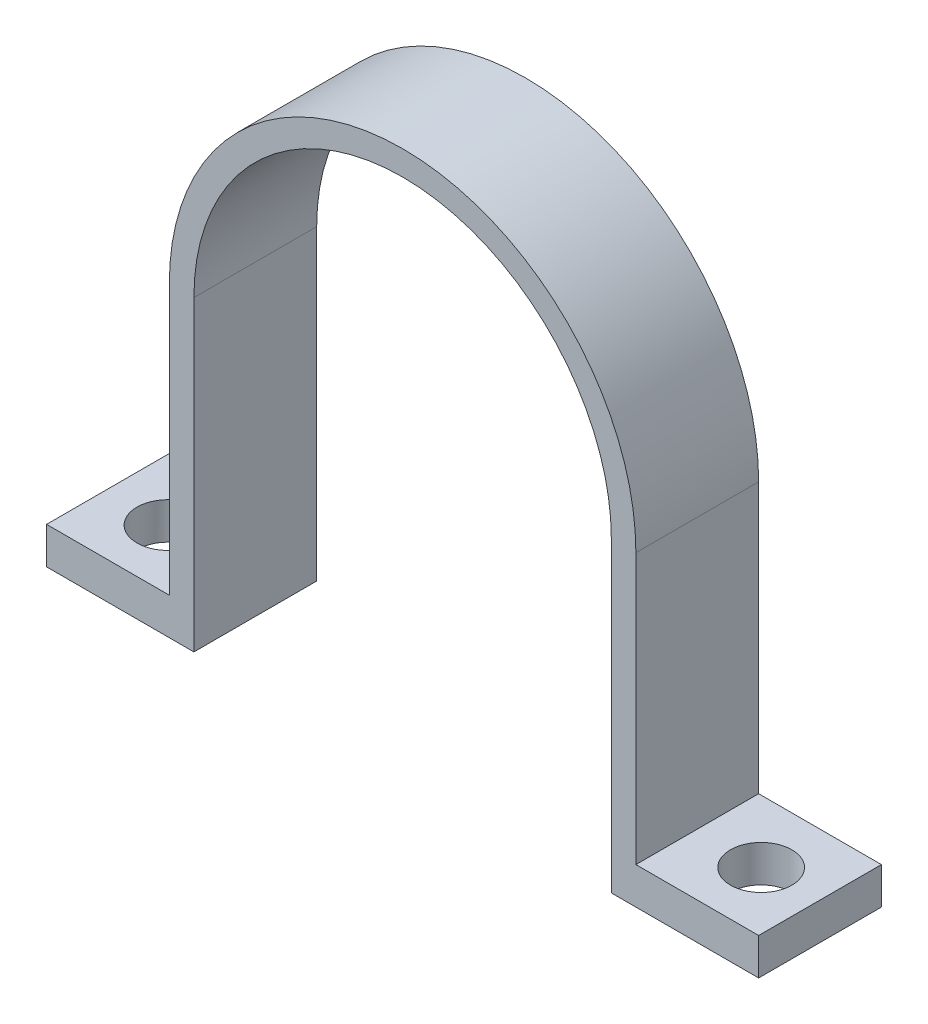
ISO-10303-21;
HEADER;
FILE_DESCRIPTION(('STEP AP214'),'2;1');
FILE_NAME('part.step','',(''),(''),'','','');
FILE_SCHEMA(('AUTOMOTIVE_DESIGN { 1 0 10303 214 1 1 1 1 }'));
ENDSEC;
DATA;
#1=APPLICATION_CONTEXT('core data for automotive mechanical design processes');
#2=APPLICATION_PROTOCOL_DEFINITION('international standard','automotive_design',2000,#1);
#3=PRODUCT_CONTEXT('',#1,'mechanical');
#4=PRODUCT('Part','Part','',(#3));
#5=PRODUCT_RELATED_PRODUCT_CATEGORY('part','',(#4));
#6=PRODUCT_DEFINITION_FORMATION('','',#4);
#7=PRODUCT_DEFINITION_CONTEXT('part definition',#1,'design');
#8=PRODUCT_DEFINITION('design','',#6,#7);
#9=PRODUCT_DEFINITION_SHAPE('','',#8);
#10=(LENGTH_UNIT() NAMED_UNIT(*) SI_UNIT(.MILLI.,.METRE.));
#11=(NAMED_UNIT(*) PLANE_ANGLE_UNIT() SI_UNIT($,.RADIAN.));
#12=(NAMED_UNIT(*) SI_UNIT($,.STERADIAN.) SOLID_ANGLE_UNIT());
#13=UNCERTAINTY_MEASURE_WITH_UNIT(LENGTH_MEASURE(1.E-05),#10,'distance_accuracy_value','');
#14=(GEOMETRIC_REPRESENTATION_CONTEXT(3) GLOBAL_UNCERTAINTY_ASSIGNED_CONTEXT((#13)) GLOBAL_UNIT_ASSIGNED_CONTEXT((#10,
#11,#12)) REPRESENTATION_CONTEXT('',''));
#15=CARTESIAN_POINT('',(0.,0.,0.));
#16=DIRECTION('',(0.,0.,1.));
#17=DIRECTION('',(1.,0.,0.));
#18=AXIS2_PLACEMENT_3D('',#15,#16,#17);
#19=CARTESIAN_POINT('',(-17.,0.,10.));
#20=DIRECTION('',(-1.,0.,0.));
#21=DIRECTION('',(0.,-1.,0.));
#22=AXIS2_PLACEMENT_3D('',#19,#20,#21);
#23=PLANE('',#22);
#24=DIRECTION('',(0.,1.,0.));
#25=VECTOR('',#24,1.);
#26=CARTESIAN_POINT('',(-17.,0.,0.));
#27=LINE('',#26,#25);
#28=CARTESIAN_POINT('',(-17.,-25.,0.));
#29=VERTEX_POINT('',#28);
#30=CARTESIAN_POINT('',(-17.,0.,0.));
#31=VERTEX_POINT('',#30);
#32=EDGE_CURVE('E98',#29,#31,#27,.T.);
#33=ORIENTED_EDGE('',*,*,#32,.T.);
#34=DIRECTION('',(0.,0.,-1.));
#35=VECTOR('',#34,1.);
#36=CARTESIAN_POINT('',(-17.,0.,10.));
#37=LINE('',#36,#35);
#38=CARTESIAN_POINT('',(-17.,0.,10.));
#39=VERTEX_POINT('',#38);
#40=EDGE_CURVE('E11',#39,#31,#37,.T.);
#41=ORIENTED_EDGE('',*,*,#40,.F.);
#42=DIRECTION('',(0.,1.,0.));
#43=VECTOR('',#42,1.);
#44=CARTESIAN_POINT('',(-17.,-25.,10.));
#45=LINE('',#44,#43);
#46=CARTESIAN_POINT('',(-17.,-25.,10.));
#47=VERTEX_POINT('',#46);
#48=EDGE_CURVE('E104',#47,#39,#45,.T.);
#49=ORIENTED_EDGE('',*,*,#48,.F.);
#50=DIRECTION('',(0.,0.,-1.));
#51=VECTOR('',#50,1.);
#52=CARTESIAN_POINT('',(-17.,-25.,10.));
#53=LINE('',#52,#51);
#54=EDGE_CURVE('E150',#47,#29,#53,.T.);
#55=ORIENTED_EDGE('',*,*,#54,.T.);
#56=EDGE_LOOP('',(#33,#41,#49,#55));
#57=FACE_BOUND('',#56,.T.);
#58=ADVANCED_FACE('F33',(#57),#23,.F.);
#59=CARTESIAN_POINT('',(0.,0.,10.));
#60=DIRECTION('',(0.,0.,-1.));
#61=DIRECTION('',(-1.,0.,0.));
#62=AXIS2_PLACEMENT_3D('',#59,#60,#61);
#63=CYLINDRICAL_SURFACE('',#62,17.);
#64=CARTESIAN_POINT('',(0.,0.,0.));
#65=DIRECTION('',(0.,0.,-1.));
#66=DIRECTION('',(1.,0.,0.));
#67=AXIS2_PLACEMENT_3D('',#64,#65,#66);
#68=CIRCLE('',#67,17.);
#69=CARTESIAN_POINT('',(17.,0.,0.));
#70=VERTEX_POINT('',#69);
#71=EDGE_CURVE('E155',#31,#70,#68,.T.);
#72=ORIENTED_EDGE('',*,*,#71,.T.);
#73=DIRECTION('',(0.,0.,-1.));
#74=VECTOR('',#73,1.);
#75=CARTESIAN_POINT('',(17.,0.,10.));
#76=LINE('',#75,#74);
#77=CARTESIAN_POINT('',(17.,0.,10.));
#78=VERTEX_POINT('',#77);
#79=EDGE_CURVE('E42',#78,#70,#76,.T.);
#80=ORIENTED_EDGE('',*,*,#79,.F.);
#81=CARTESIAN_POINT('',(0.,0.,10.));
#82=DIRECTION('',(0.,0.,-1.));
#83=DIRECTION('',(1.,0.,0.));
#84=AXIS2_PLACEMENT_3D('',#81,#82,#83);
#85=CIRCLE('',#84,17.);
#86=EDGE_CURVE('E208',#39,#78,#85,.T.);
#87=ORIENTED_EDGE('',*,*,#86,.F.);
#88=ORIENTED_EDGE('',*,*,#40,.T.);
#89=EDGE_LOOP('',(#72,#80,#87,#88));
#90=FACE_BOUND('',#89,.T.);
#91=ADVANCED_FACE('F207',(#90),#63,.F.);
#92=CARTESIAN_POINT('',(17.,-24.,10.));
#93=DIRECTION('',(1.,0.,0.));
#94=DIRECTION('',(0.,0.,-1.));
#95=AXIS2_PLACEMENT_3D('',#92,#93,#94);
#96=PLANE('',#95);
#97=DIRECTION('',(0.,-1.,0.));
#98=VECTOR('',#97,1.);
#99=CARTESIAN_POINT('',(17.,-24.,0.));
#100=LINE('',#99,#98);
#101=CARTESIAN_POINT('',(17.,-25.,0.));
#102=VERTEX_POINT('',#101);
#103=EDGE_CURVE('E158',#70,#102,#100,.T.);
#104=ORIENTED_EDGE('',*,*,#103,.T.);
#105=DIRECTION('',(0.,0.,-1.));
#106=VECTOR('',#105,1.);
#107=CARTESIAN_POINT('',(17.,-25.,10.));
#108=LINE('',#107,#106);
#109=CARTESIAN_POINT('',(17.,-25.,10.));
#110=VERTEX_POINT('',#109);
#111=EDGE_CURVE('E195',#110,#102,#108,.T.);
#112=ORIENTED_EDGE('',*,*,#111,.F.);
#113=DIRECTION('',(0.,-1.,0.));
#114=VECTOR('',#113,1.);
#115=CARTESIAN_POINT('',(17.,0.,10.));
#116=LINE('',#115,#114);
#117=EDGE_CURVE('E204',#78,#110,#116,.T.);
#118=ORIENTED_EDGE('',*,*,#117,.F.);
#119=ORIENTED_EDGE('',*,*,#79,.T.);
#120=EDGE_LOOP('',(#104,#112,#118,#119));
#121=FACE_BOUND('',#120,.T.);
#122=ADVANCED_FACE('F202',(#121),#96,.F.);
#123=CARTESIAN_POINT('',(17.,-25.,10.));
#124=DIRECTION('',(0.,1.,0.));
#125=DIRECTION('',(0.,0.,1.));
#126=AXIS2_PLACEMENT_3D('',#123,#124,#125);
#127=PLANE('',#126);
#128=CARTESIAN_POINT('',(24.3048598370734,-25.,5.10100353092469));
#129=DIRECTION('',(0.,1.,0.));
#130=DIRECTION('',(0.,0.,1.));
#131=AXIS2_PLACEMENT_3D('',#128,#129,#130);
#132=CIRCLE('',#131,2.5);
#133=CARTESIAN_POINT('',(24.3048598370734,-25.,7.60100353092469));
#134=VERTEX_POINT('',#133);
#135=EDGE_CURVE('E252',#134,#134,#132,.T.);
#136=ORIENTED_EDGE('',*,*,#135,.T.);
#137=EDGE_LOOP('',(#136));
#138=FACE_BOUND('',#137,.T.);
#139=DIRECTION('',(1.,0.,0.));
#140=VECTOR('',#139,1.);
#141=CARTESIAN_POINT('',(17.,-25.,0.));
#142=LINE('',#141,#140);
#143=CARTESIAN_POINT('',(29.,-25.,0.));
#144=VERTEX_POINT('',#143);
#145=EDGE_CURVE('E160',#102,#144,#142,.T.);
#146=ORIENTED_EDGE('',*,*,#145,.T.);
#147=DIRECTION('',(0.,0.,-1.));
#148=VECTOR('',#147,1.);
#149=CARTESIAN_POINT('',(29.,-25.,10.));
#150=LINE('',#149,#148);
#151=CARTESIAN_POINT('',(29.,-25.,10.));
#152=VERTEX_POINT('',#151);
#153=EDGE_CURVE('E192',#152,#144,#150,.T.);
#154=ORIENTED_EDGE('',*,*,#153,.F.);
#155=DIRECTION('',(1.,0.,0.));
#156=VECTOR('',#155,1.);
#157=CARTESIAN_POINT('',(17.,-25.,10.));
#158=LINE('',#157,#156);
#159=EDGE_CURVE('E224',#110,#152,#158,.T.);
#160=ORIENTED_EDGE('',*,*,#159,.F.);
#161=ORIENTED_EDGE('',*,*,#111,.T.);
#162=EDGE_LOOP('',(#146,#154,#160,#161));
#163=FACE_BOUND('',#162,.T.);
#164=ADVANCED_FACE('F215',(#138,#163),#127,.F.);
#165=CARTESIAN_POINT('',(29.,-22.,10.));
#166=DIRECTION('',(-1.,0.,0.));
#167=DIRECTION('',(0.,0.,1.));
#168=AXIS2_PLACEMENT_3D('',#165,#166,#167);
#169=PLANE('',#168);
#170=DIRECTION('',(0.,1.,0.));
#171=VECTOR('',#170,1.);
#172=CARTESIAN_POINT('',(29.,-22.,0.));
#173=LINE('',#172,#171);
#174=CARTESIAN_POINT('',(29.,-22.,0.));
#175=VERTEX_POINT('',#174);
#176=EDGE_CURVE('E162',#144,#175,#173,.T.);
#177=ORIENTED_EDGE('',*,*,#176,.T.);
#178=DIRECTION('',(0.,0.,-1.));
#179=VECTOR('',#178,1.);
#180=CARTESIAN_POINT('',(29.,-22.,10.));
#181=LINE('',#180,#179);
#182=CARTESIAN_POINT('',(29.,-22.,10.));
#183=VERTEX_POINT('',#182);
#184=EDGE_CURVE('E189',#183,#175,#181,.T.);
#185=ORIENTED_EDGE('',*,*,#184,.F.);
#186=DIRECTION('',(0.,1.,0.));
#187=VECTOR('',#186,1.);
#188=CARTESIAN_POINT('',(29.,-22.,10.));
#189=LINE('',#188,#187);
#190=EDGE_CURVE('E221',#152,#183,#189,.T.);
#191=ORIENTED_EDGE('',*,*,#190,.F.);
#192=ORIENTED_EDGE('',*,*,#153,.T.);
#193=EDGE_LOOP('',(#177,#185,#191,#192));
#194=FACE_BOUND('',#193,.T.);
#195=ADVANCED_FACE('F219',(#194),#169,.F.);
#196=CARTESIAN_POINT('',(19.,-22.,10.));
#197=DIRECTION('',(0.,-1.,0.));
#198=DIRECTION('',(0.,0.,-1.));
#199=AXIS2_PLACEMENT_3D('',#196,#197,#198);
#200=PLANE('',#199);
#201=CARTESIAN_POINT('',(24.3048598370734,-22.,5.10100353092469));
#202=DIRECTION('',(0.,1.,0.));
#203=DIRECTION('',(0.,0.,1.));
#204=AXIS2_PLACEMENT_3D('',#201,#202,#203);
#205=CIRCLE('',#204,2.5);
#206=CARTESIAN_POINT('',(24.3048598370734,-22.,7.60100353092469));
#207=VERTEX_POINT('',#206);
#208=EDGE_CURVE('E255',#207,#207,#205,.T.);
#209=ORIENTED_EDGE('',*,*,#208,.F.);
#210=EDGE_LOOP('',(#209));
#211=FACE_BOUND('',#210,.T.);
#212=DIRECTION('',(-1.,0.,0.));
#213=VECTOR('',#212,1.);
#214=CARTESIAN_POINT('',(19.,-22.,0.));
#215=LINE('',#214,#213);
#216=CARTESIAN_POINT('',(19.,-22.,0.));
#217=VERTEX_POINT('',#216);
#218=EDGE_CURVE('E164',#175,#217,#215,.T.);
#219=ORIENTED_EDGE('',*,*,#218,.T.);
#220=DIRECTION('',(0.,0.,-1.));
#221=VECTOR('',#220,1.);
#222=CARTESIAN_POINT('',(19.,-22.,10.));
#223=LINE('',#222,#221);
#224=CARTESIAN_POINT('',(19.,-22.,10.));
#225=VERTEX_POINT('',#224);
#226=EDGE_CURVE('E186',#225,#217,#223,.T.);
#227=ORIENTED_EDGE('',*,*,#226,.F.);
#228=DIRECTION('',(-1.,0.,0.));
#229=VECTOR('',#228,1.);
#230=CARTESIAN_POINT('',(19.,-22.,10.));
#231=LINE('',#230,#229);
#232=EDGE_CURVE('E223',#183,#225,#231,.T.);
#233=ORIENTED_EDGE('',*,*,#232,.F.);
#234=ORIENTED_EDGE('',*,*,#184,.T.);
#235=EDGE_LOOP('',(#219,#227,#233,#234));
#236=FACE_BOUND('',#235,.T.);
#237=ADVANCED_FACE('F262',(#211,#236),#200,.F.);
#238=CARTESIAN_POINT('',(19.,0.,10.));
#239=DIRECTION('',(-1.,0.,0.));
#240=DIRECTION('',(0.,-1.,0.));
#241=AXIS2_PLACEMENT_3D('',#238,#239,#240);
#242=PLANE('',#241);
#243=DIRECTION('',(0.,1.,0.));
#244=VECTOR('',#243,1.);
#245=CARTESIAN_POINT('',(19.,0.,0.));
#246=LINE('',#245,#244);
#247=CARTESIAN_POINT('',(19.,0.,0.));
#248=VERTEX_POINT('',#247);
#249=EDGE_CURVE('E166',#217,#248,#246,.T.);
#250=ORIENTED_EDGE('',*,*,#249,.T.);
#251=DIRECTION('',(0.,0.,-1.));
#252=VECTOR('',#251,1.);
#253=CARTESIAN_POINT('',(19.,0.,10.));
#254=LINE('',#253,#252);
#255=CARTESIAN_POINT('',(19.,0.,10.));
#256=VERTEX_POINT('',#255);
#257=EDGE_CURVE('E183',#256,#248,#254,.T.);
#258=ORIENTED_EDGE('',*,*,#257,.F.);
#259=DIRECTION('',(0.,1.,0.));
#260=VECTOR('',#259,1.);
#261=CARTESIAN_POINT('',(19.,0.,10.));
#262=LINE('',#261,#260);
#263=EDGE_CURVE('E226',#225,#256,#262,.T.);
#264=ORIENTED_EDGE('',*,*,#263,.F.);
#265=ORIENTED_EDGE('',*,*,#226,.T.);
#266=EDGE_LOOP('',(#250,#258,#264,#265));
#267=FACE_BOUND('',#266,.T.);
#268=ADVANCED_FACE('F265',(#267),#242,.F.);
#269=CARTESIAN_POINT('',(0.,0.,10.));
#270=DIRECTION('',(0.,0.,-1.));
#271=DIRECTION('',(-1.,0.,0.));
#272=AXIS2_PLACEMENT_3D('',#269,#270,#271);
#273=CYLINDRICAL_SURFACE('',#272,19.);
#274=CARTESIAN_POINT('',(0.,0.,0.));
#275=DIRECTION('',(0.,0.,1.));
#276=DIRECTION('',(1.,0.,0.));
#277=AXIS2_PLACEMENT_3D('',#274,#275,#276);
#278=CIRCLE('',#277,19.);
#279=CARTESIAN_POINT('',(-19.,0.,0.));
#280=VERTEX_POINT('',#279);
#281=EDGE_CURVE('E168',#248,#280,#278,.T.);
#282=ORIENTED_EDGE('',*,*,#281,.T.);
#283=DIRECTION('',(0.,0.,-1.));
#284=VECTOR('',#283,1.);
#285=CARTESIAN_POINT('',(-19.,0.,10.));
#286=LINE('',#285,#284);
#287=CARTESIAN_POINT('',(-19.,0.,10.));
#288=VERTEX_POINT('',#287);
#289=EDGE_CURVE('E180',#288,#280,#286,.T.);
#290=ORIENTED_EDGE('',*,*,#289,.F.);
#291=CARTESIAN_POINT('',(0.,0.,10.));
#292=DIRECTION('',(0.,0.,1.));
#293=DIRECTION('',(1.,0.,0.));
#294=AXIS2_PLACEMENT_3D('',#291,#292,#293);
#295=CIRCLE('',#294,19.);
#296=EDGE_CURVE('E232',#256,#288,#295,.T.);
#297=ORIENTED_EDGE('',*,*,#296,.F.);
#298=ORIENTED_EDGE('',*,*,#257,.T.);
#299=EDGE_LOOP('',(#282,#290,#297,#298));
#300=FACE_BOUND('',#299,.T.);
#301=ADVANCED_FACE('F238',(#300),#273,.T.);
#302=CARTESIAN_POINT('',(-19.,0.,10.));
#303=DIRECTION('',(1.,0.,0.));
#304=DIRECTION('',(0.,1.,0.));
#305=AXIS2_PLACEMENT_3D('',#302,#303,#304);
#306=PLANE('',#305);
#307=DIRECTION('',(0.,-1.,0.));
#308=VECTOR('',#307,1.);
#309=CARTESIAN_POINT('',(-19.,0.,0.));
#310=LINE('',#309,#308);
#311=CARTESIAN_POINT('',(-19.,-22.,0.));
#312=VERTEX_POINT('',#311);
#313=EDGE_CURVE('E170',#280,#312,#310,.T.);
#314=ORIENTED_EDGE('',*,*,#313,.T.);
#315=DIRECTION('',(0.,0.,-1.));
#316=VECTOR('',#315,1.);
#317=CARTESIAN_POINT('',(-19.,-22.,10.));
#318=LINE('',#317,#316);
#319=CARTESIAN_POINT('',(-19.,-22.,10.));
#320=VERTEX_POINT('',#319);
#321=EDGE_CURVE('E145',#320,#312,#318,.T.);
#322=ORIENTED_EDGE('',*,*,#321,.F.);
#323=DIRECTION('',(0.,-1.,0.));
#324=VECTOR('',#323,1.);
#325=CARTESIAN_POINT('',(-19.,0.,10.));
#326=LINE('',#325,#324);
#327=EDGE_CURVE('E136',#288,#320,#326,.T.);
#328=ORIENTED_EDGE('',*,*,#327,.F.);
#329=ORIENTED_EDGE('',*,*,#289,.T.);
#330=EDGE_LOOP('',(#314,#322,#328,#329));
#331=FACE_BOUND('',#330,.T.);
#332=ADVANCED_FACE('F242',(#331),#306,.F.);
#333=CARTESIAN_POINT('',(-29.,-22.,10.));
#334=DIRECTION('',(0.,-1.,0.));
#335=DIRECTION('',(0.,0.,-1.));
#336=AXIS2_PLACEMENT_3D('',#333,#334,#335);
#337=PLANE('',#336);
#338=CARTESIAN_POINT('',(-24.,-22.,5.10100353092469));
#339=DIRECTION('',(0.,1.,0.));
#340=DIRECTION('',(0.,0.,1.));
#341=AXIS2_PLACEMENT_3D('',#338,#339,#340);
#342=CIRCLE('',#341,2.53492760473778);
#343=CARTESIAN_POINT('',(-24.,-22.,7.63593113566247));
#344=VERTEX_POINT('',#343);
#345=EDGE_CURVE('E249',#344,#344,#342,.T.);
#346=ORIENTED_EDGE('',*,*,#345,.F.);
#347=EDGE_LOOP('',(#346));
#348=FACE_BOUND('',#347,.T.);
#349=DIRECTION('',(-1.,0.,0.));
#350=VECTOR('',#349,1.);
#351=CARTESIAN_POINT('',(-29.,-22.,0.));
#352=LINE('',#351,#350);
#353=CARTESIAN_POINT('',(-29.,-22.,0.));
#354=VERTEX_POINT('',#353);
#355=EDGE_CURVE('E144',#312,#354,#352,.T.);
#356=ORIENTED_EDGE('',*,*,#355,.T.);
#357=DIRECTION('',(0.,0.,-1.));
#358=VECTOR('',#357,1.);
#359=CARTESIAN_POINT('',(-29.,-22.,10.));
#360=LINE('',#359,#358);
#361=CARTESIAN_POINT('',(-29.,-22.,10.));
#362=VERTEX_POINT('',#361);
#363=EDGE_CURVE('E141',#362,#354,#360,.T.);
#364=ORIENTED_EDGE('',*,*,#363,.F.);
#365=DIRECTION('',(-1.,0.,0.));
#366=VECTOR('',#365,1.);
#367=CARTESIAN_POINT('',(-29.,-22.,10.));
#368=LINE('',#367,#366);
#369=EDGE_CURVE('E130',#320,#362,#368,.T.);
#370=ORIENTED_EDGE('',*,*,#369,.F.);
#371=ORIENTED_EDGE('',*,*,#321,.T.);
#372=EDGE_LOOP('',(#356,#364,#370,#371));
#373=FACE_BOUND('',#372,.T.);
#374=ADVANCED_FACE('F142',(#348,#373),#337,.F.);
#375=CARTESIAN_POINT('',(-29.,-25.,10.));
#376=DIRECTION('',(1.,0.,0.));
#377=DIRECTION('',(0.,0.,-1.));
#378=AXIS2_PLACEMENT_3D('',#375,#376,#377);
#379=PLANE('',#378);
#380=DIRECTION('',(0.,-1.,0.));
#381=VECTOR('',#380,1.);
#382=CARTESIAN_POINT('',(-29.,-25.,0.));
#383=LINE('',#382,#381);
#384=CARTESIAN_POINT('',(-29.,-25.,0.));
#385=VERTEX_POINT('',#384);
#386=EDGE_CURVE('E91',#354,#385,#383,.T.);
#387=ORIENTED_EDGE('',*,*,#386,.T.);
#388=DIRECTION('',(0.,0.,-1.));
#389=VECTOR('',#388,1.);
#390=CARTESIAN_POINT('',(-29.,-25.,10.));
#391=LINE('',#390,#389);
#392=CARTESIAN_POINT('',(-29.,-25.,10.));
#393=VERTEX_POINT('',#392);
#394=EDGE_CURVE('E146',#393,#385,#391,.T.);
#395=ORIENTED_EDGE('',*,*,#394,.F.);
#396=DIRECTION('',(0.,-1.,0.));
#397=VECTOR('',#396,1.);
#398=CARTESIAN_POINT('',(-29.,-25.,10.));
#399=LINE('',#398,#397);
#400=EDGE_CURVE('E134',#362,#393,#399,.T.);
#401=ORIENTED_EDGE('',*,*,#400,.F.);
#402=ORIENTED_EDGE('',*,*,#363,.T.);
#403=EDGE_LOOP('',(#387,#395,#401,#402));
#404=FACE_BOUND('',#403,.T.);
#405=ADVANCED_FACE('F148',(#404),#379,.F.);
#406=CARTESIAN_POINT('',(-29.,-25.,10.));
#407=DIRECTION('',(0.,1.,0.));
#408=DIRECTION('',(-1.,0.,0.));
#409=AXIS2_PLACEMENT_3D('',#406,#407,#408);
#410=PLANE('',#409);
#411=CARTESIAN_POINT('',(-24.,-25.,5.10100353092469));
#412=DIRECTION('',(0.,1.,0.));
#413=DIRECTION('',(-1.,0.,0.));
#414=AXIS2_PLACEMENT_3D('',#411,#412,#413);
#415=CIRCLE('',#414,2.53492760473778);
#416=CARTESIAN_POINT('',(-26.5349276047378,-25.,5.10100353092469));
#417=VERTEX_POINT('',#416);
#418=EDGE_CURVE('E36',#417,#417,#415,.T.);
#419=ORIENTED_EDGE('',*,*,#418,.T.);
#420=EDGE_LOOP('',(#419));
#421=FACE_BOUND('',#420,.T.);
#422=DIRECTION('',(1.,0.,0.));
#423=VECTOR('',#422,1.);
#424=CARTESIAN_POINT('',(-29.,-25.,0.));
#425=LINE('',#424,#423);
#426=EDGE_CURVE('E174',#385,#29,#425,.T.);
#427=ORIENTED_EDGE('',*,*,#426,.T.);
#428=ORIENTED_EDGE('',*,*,#54,.F.);
#429=DIRECTION('',(1.,0.,0.));
#430=VECTOR('',#429,1.);
#431=CARTESIAN_POINT('',(-29.,-25.,10.));
#432=LINE('',#431,#430);
#433=EDGE_CURVE('E50',#393,#47,#432,.T.);
#434=ORIENTED_EDGE('',*,*,#433,.F.);
#435=ORIENTED_EDGE('',*,*,#394,.T.);
#436=EDGE_LOOP('',(#427,#428,#434,#435));
#437=FACE_BOUND('',#436,.T.);
#438=ADVANCED_FACE('F244',(#421,#437),#410,.F.);
#439=CARTESIAN_POINT('',(0.,0.,10.));
#440=DIRECTION('',(0.,0.,1.));
#441=DIRECTION('',(1.,0.,0.));
#442=AXIS2_PLACEMENT_3D('',#439,#440,#441);
#443=PLANE('',#442);
#444=ORIENTED_EDGE('',*,*,#48,.T.);
#445=ORIENTED_EDGE('',*,*,#86,.T.);
#446=ORIENTED_EDGE('',*,*,#117,.T.);
#447=ORIENTED_EDGE('',*,*,#159,.T.);
#448=ORIENTED_EDGE('',*,*,#190,.T.);
#449=ORIENTED_EDGE('',*,*,#232,.T.);
#450=ORIENTED_EDGE('',*,*,#263,.T.);
#451=ORIENTED_EDGE('',*,*,#296,.T.);
#452=ORIENTED_EDGE('',*,*,#327,.T.);
#453=ORIENTED_EDGE('',*,*,#369,.T.);
#454=ORIENTED_EDGE('',*,*,#400,.T.);
#455=ORIENTED_EDGE('',*,*,#433,.T.);
#456=EDGE_LOOP('',(#444,#445,#446,#447,#448,#449,#450,#451,#452,#453,#454,#455));
#457=FACE_BOUND('',#456,.T.);
#458=ADVANCED_FACE('F132',(#457),#443,.T.);
#459=CARTESIAN_POINT('',(0.,0.,0.));
#460=DIRECTION('',(0.,0.,1.));
#461=DIRECTION('',(1.,0.,0.));
#462=AXIS2_PLACEMENT_3D('',#459,#460,#461);
#463=PLANE('',#462);
#464=ORIENTED_EDGE('',*,*,#32,.F.);
#465=ORIENTED_EDGE('',*,*,#426,.F.);
#466=ORIENTED_EDGE('',*,*,#386,.F.);
#467=ORIENTED_EDGE('',*,*,#355,.F.);
#468=ORIENTED_EDGE('',*,*,#313,.F.);
#469=ORIENTED_EDGE('',*,*,#281,.F.);
#470=ORIENTED_EDGE('',*,*,#249,.F.);
#471=ORIENTED_EDGE('',*,*,#218,.F.);
#472=ORIENTED_EDGE('',*,*,#176,.F.);
#473=ORIENTED_EDGE('',*,*,#145,.F.);
#474=ORIENTED_EDGE('',*,*,#103,.F.);
#475=ORIENTED_EDGE('',*,*,#71,.F.);
#476=EDGE_LOOP('',(#464,#465,#466,#467,#468,#469,#470,#471,#472,#473,#474,#475));
#477=FACE_BOUND('',#476,.T.);
#478=ADVANCED_FACE('F209',(#477),#463,.F.);
#479=CARTESIAN_POINT('',(-24.,-32.,5.10100353092469));
#480=DIRECTION('',(0.,1.,0.));
#481=DIRECTION('',(0.,0.,1.));
#482=AXIS2_PLACEMENT_3D('',#479,#480,#481);
#483=CYLINDRICAL_SURFACE('',#482,2.53492760473778);
#484=ORIENTED_EDGE('',*,*,#345,.T.);
#485=EDGE_LOOP('',(#484));
#486=FACE_BOUND('',#485,.T.);
#487=ORIENTED_EDGE('',*,*,#418,.F.);
#488=EDGE_LOOP('',(#487));
#489=FACE_BOUND('',#488,.T.);
#490=ADVANCED_FACE('F331',(#486,#489),#483,.F.);
#491=CARTESIAN_POINT('',(24.3048598370734,-32.,5.10100353092469));
#492=DIRECTION('',(0.,1.,0.));
#493=DIRECTION('',(0.,0.,1.));
#494=AXIS2_PLACEMENT_3D('',#491,#492,#493);
#495=CYLINDRICAL_SURFACE('',#494,2.5);
#496=ORIENTED_EDGE('',*,*,#208,.T.);
#497=EDGE_LOOP('',(#496));
#498=FACE_BOUND('',#497,.T.);
#499=ORIENTED_EDGE('',*,*,#135,.F.);
#500=EDGE_LOOP('',(#499));
#501=FACE_BOUND('',#500,.T.);
#502=ADVANCED_FACE('F259',(#498,#501),#495,.F.);
#503=CLOSED_SHELL('',(#58,#91,#122,#164,#195,#237,#268,#301,#332,#374,#405,#438,#458,#478,#490,#502));
#504=MANIFOLD_SOLID_BREP('B2',#503);
#505=ADVANCED_BREP_SHAPE_REPRESENTATION('',(#18,#504),#14);
#506=SHAPE_DEFINITION_REPRESENTATION(#9,#505);
ENDSEC;
END-ISO-10303-21;
